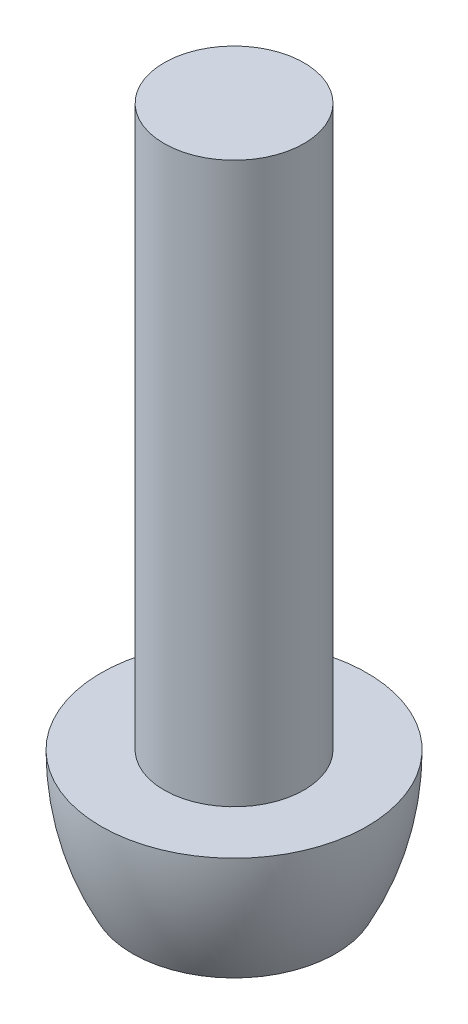
ISO-10303-21;
HEADER;
FILE_DESCRIPTION(('STEP AP214'),'2;1');
FILE_NAME('part.step','',(''),(''),'','','');
FILE_SCHEMA(('AUTOMOTIVE_DESIGN { 1 0 10303 214 1 1 1 1 }'));
ENDSEC;
DATA;
#1=APPLICATION_CONTEXT('core data for automotive mechanical design processes');
#2=APPLICATION_PROTOCOL_DEFINITION('international standard','automotive_design',2000,#1);
#3=PRODUCT_CONTEXT('',#1,'mechanical');
#4=PRODUCT('Part','Part','',(#3));
#5=PRODUCT_RELATED_PRODUCT_CATEGORY('part','',(#4));
#6=PRODUCT_DEFINITION_FORMATION('','',#4);
#7=PRODUCT_DEFINITION_CONTEXT('part definition',#1,'design');
#8=PRODUCT_DEFINITION('design','',#6,#7);
#9=PRODUCT_DEFINITION_SHAPE('','',#8);
#10=(LENGTH_UNIT() NAMED_UNIT(*) SI_UNIT(.MILLI.,.METRE.));
#11=(NAMED_UNIT(*) PLANE_ANGLE_UNIT() SI_UNIT($,.RADIAN.));
#12=(NAMED_UNIT(*) SI_UNIT($,.STERADIAN.) SOLID_ANGLE_UNIT());
#13=UNCERTAINTY_MEASURE_WITH_UNIT(LENGTH_MEASURE(1.E-05),#10,'distance_accuracy_value','');
#14=(GEOMETRIC_REPRESENTATION_CONTEXT(3) GLOBAL_UNCERTAINTY_ASSIGNED_CONTEXT((#13)) GLOBAL_UNIT_ASSIGNED_CONTEXT((#10,
#11,#12)) REPRESENTATION_CONTEXT('',''));
#15=CARTESIAN_POINT('',(0.,0.,0.));
#16=DIRECTION('',(0.,0.,1.));
#17=DIRECTION('',(1.,0.,0.));
#18=AXIS2_PLACEMENT_3D('',#15,#16,#17);
#19=CARTESIAN_POINT('',(0.,8.,0.));
#20=DIRECTION('',(0.,-1.,0.));
#21=DIRECTION('',(0.,0.,-1.));
#22=AXIS2_PLACEMENT_3D('',#19,#20,#21);
#23=CYLINDRICAL_SURFACE('',#22,1.);
#24=CARTESIAN_POINT('',(0.,8.,0.));
#25=DIRECTION('',(0.,1.,0.));
#26=DIRECTION('',(0.,0.,1.));
#27=AXIS2_PLACEMENT_3D('',#24,#25,#26);
#28=CIRCLE('',#27,1.);
#29=CARTESIAN_POINT('',(0.,8.,1.));
#30=VERTEX_POINT('',#29);
#31=EDGE_CURVE('E11',#30,#30,#28,.T.);
#32=ORIENTED_EDGE('',*,*,#31,.F.);
#33=EDGE_LOOP('',(#32));
#34=FACE_BOUND('',#33,.T.);
#35=CARTESIAN_POINT('',(0.,0.,0.));
#36=DIRECTION('',(0.,1.,0.));
#37=DIRECTION('',(0.,0.,1.));
#38=AXIS2_PLACEMENT_3D('',#35,#36,#37);
#39=CIRCLE('',#38,1.);
#40=CARTESIAN_POINT('',(0.,0.,1.));
#41=VERTEX_POINT('',#40);
#42=EDGE_CURVE('E40',#41,#41,#39,.T.);
#43=ORIENTED_EDGE('',*,*,#42,.T.);
#44=EDGE_LOOP('',(#43));
#45=FACE_BOUND('',#44,.T.);
#46=ADVANCED_FACE('F37',(#34,#45),#23,.T.);
#47=CARTESIAN_POINT('',(0.,8.,0.));
#48=DIRECTION('',(0.,1.,0.));
#49=DIRECTION('',(0.,0.,1.));
#50=AXIS2_PLACEMENT_3D('',#47,#48,#49);
#51=PLANE('',#50);
#52=ORIENTED_EDGE('',*,*,#31,.T.);
#53=EDGE_LOOP('',(#52));
#54=FACE_BOUND('',#53,.T.);
#55=ADVANCED_FACE('F158',(#54),#51,.T.);
#56=CARTESIAN_POINT('',(0.,0.,0.));
#57=DIRECTION('',(0.,1.,0.));
#58=DIRECTION('',(0.,0.,1.));
#59=AXIS2_PLACEMENT_3D('',#56,#57,#58);
#60=PLANE('',#59);
#61=ORIENTED_EDGE('',*,*,#42,.F.);
#62=EDGE_LOOP('',(#61));
#63=FACE_BOUND('',#62,.T.);
#64=CARTESIAN_POINT('',(0.,0.,0.));
#65=DIRECTION('',(0.,1.,0.));
#66=DIRECTION('',(0.,0.,1.));
#67=AXIS2_PLACEMENT_3D('',#64,#65,#66);
#68=CIRCLE('',#67,1.9);
#69=CARTESIAN_POINT('',(0.,0.,1.9));
#70=VERTEX_POINT('',#69);
#71=EDGE_CURVE('E138',#70,#70,#68,.T.);
#72=ORIENTED_EDGE('',*,*,#71,.T.);
#73=EDGE_LOOP('',(#72));
#74=FACE_BOUND('',#73,.T.);
#75=ADVANCED_FACE('F154',(#63,#74),#60,.T.);
#76=CARTESIAN_POINT('',(0.,0.,0.));
#77=DIRECTION('',(0.,1.,0.));
#78=DIRECTION('',(0.,0.,1.));
#79=AXIS2_PLACEMENT_3D('',#76,#77,#78);
#80=DEGENERATE_TOROIDAL_SURFACE('',#79,1.925,3.825,.F.);
#81=ORIENTED_EDGE('',*,*,#71,.F.);
#82=EDGE_LOOP('',(#81));
#83=FACE_BOUND('',#82,.T.);
#84=CARTESIAN_POINT('',(0.,-1.8,0.));
#85=DIRECTION('',(0.,1.,0.));
#86=DIRECTION('',(0.,0.,1.));
#87=AXIS2_PLACEMENT_3D('',#84,#85,#86);
#88=CIRCLE('',#87,1.45);
#89=CARTESIAN_POINT('',(0.,-1.8,1.45));
#90=VERTEX_POINT('',#89);
#91=EDGE_CURVE('E146',#90,#90,#88,.T.);
#92=ORIENTED_EDGE('',*,*,#91,.T.);
#93=EDGE_LOOP('',(#92));
#94=FACE_BOUND('',#93,.T.);
#95=ADVANCED_FACE('F157',(#83,#94),#80,.F.);
#96=CARTESIAN_POINT('',(0.,-1.8,0.));
#97=DIRECTION('',(0.,1.,0.));
#98=DIRECTION('',(0.,0.,1.));
#99=AXIS2_PLACEMENT_3D('',#96,#97,#98);
#100=PLANE('',#99);
#101=DIRECTION('',(1.,0.,0.));
#102=VECTOR('',#101,1.);
#103=CARTESIAN_POINT('',(-0.288675134594813,-1.8,-0.5));
#104=LINE('',#103,#102);
#105=CARTESIAN_POINT('',(-0.288675134594813,-1.8,-0.5));
#106=VERTEX_POINT('',#105);
#107=CARTESIAN_POINT('',(0.288675134594813,-1.8,-0.5));
#108=VERTEX_POINT('',#107);
#109=EDGE_CURVE('E125',#106,#108,#104,.T.);
#110=ORIENTED_EDGE('',*,*,#109,.F.);
#111=DIRECTION('',(0.5,0.,-0.866025403784439));
#112=VECTOR('',#111,1.);
#113=CARTESIAN_POINT('',(-0.577350269189626,-1.8,0.));
#114=LINE('',#113,#112);
#115=CARTESIAN_POINT('',(-0.577350269189626,-1.8,0.));
#116=VERTEX_POINT('',#115);
#117=EDGE_CURVE('E51',#116,#106,#114,.T.);
#118=ORIENTED_EDGE('',*,*,#117,.F.);
#119=DIRECTION('',(-0.5,0.,-0.866025403784438));
#120=VECTOR('',#119,1.);
#121=CARTESIAN_POINT('',(-0.288675134594813,-1.8,0.5));
#122=LINE('',#121,#120);
#123=CARTESIAN_POINT('',(-0.288675134594813,-1.8,0.5));
#124=VERTEX_POINT('',#123);
#125=EDGE_CURVE('E134',#124,#116,#122,.T.);
#126=ORIENTED_EDGE('',*,*,#125,.F.);
#127=DIRECTION('',(-1.,0.,0.));
#128=VECTOR('',#127,1.);
#129=CARTESIAN_POINT('',(0.288675134594812,-1.8,0.5));
#130=LINE('',#129,#128);
#131=CARTESIAN_POINT('',(0.288675134594812,-1.8,0.5));
#132=VERTEX_POINT('',#131);
#133=EDGE_CURVE('E132',#132,#124,#130,.T.);
#134=ORIENTED_EDGE('',*,*,#133,.F.);
#135=DIRECTION('',(-0.5,0.,0.866025403784438));
#136=VECTOR('',#135,1.);
#137=CARTESIAN_POINT('',(0.577350269189626,-1.8,0.));
#138=LINE('',#137,#136);
#139=CARTESIAN_POINT('',(0.577350269189626,-1.8,0.));
#140=VERTEX_POINT('',#139);
#141=EDGE_CURVE('E99',#140,#132,#138,.T.);
#142=ORIENTED_EDGE('',*,*,#141,.F.);
#143=DIRECTION('',(0.5,0.,0.866025403784439));
#144=VECTOR('',#143,1.);
#145=CARTESIAN_POINT('',(0.288675134594813,-1.8,-0.5));
#146=LINE('',#145,#144);
#147=EDGE_CURVE('E128',#108,#140,#146,.T.);
#148=ORIENTED_EDGE('',*,*,#147,.F.);
#149=EDGE_LOOP('',(#110,#118,#126,#134,#142,#148));
#150=FACE_BOUND('',#149,.T.);
#151=ORIENTED_EDGE('',*,*,#91,.F.);
#152=EDGE_LOOP('',(#151));
#153=FACE_BOUND('',#152,.T.);
#154=ADVANCED_FACE('F163',(#150,#153),#100,.F.);
#155=CARTESIAN_POINT('',(-0.577350269189626,-1.2,0.));
#156=DIRECTION('',(-0.866025403784439,0.,-0.5));
#157=DIRECTION('',(-0.5,0.,0.866025403784439));
#158=AXIS2_PLACEMENT_3D('',#155,#156,#157);
#159=PLANE('',#158);
#160=ORIENTED_EDGE('',*,*,#117,.T.);
#161=DIRECTION('',(0.,-1.,0.));
#162=VECTOR('',#161,1.);
#163=CARTESIAN_POINT('',(-0.288675134594813,-1.2,-0.5));
#164=LINE('',#163,#162);
#165=CARTESIAN_POINT('',(-0.288675134594813,-1.2,-0.5));
#166=VERTEX_POINT('',#165);
#167=EDGE_CURVE('E81',#166,#106,#164,.T.);
#168=ORIENTED_EDGE('',*,*,#167,.F.);
#169=DIRECTION('',(0.5,0.,-0.866025403784439));
#170=VECTOR('',#169,1.);
#171=CARTESIAN_POINT('',(-0.577350269189626,-1.2,0.));
#172=LINE('',#171,#170);
#173=CARTESIAN_POINT('',(-0.577350269189626,-1.2,0.));
#174=VERTEX_POINT('',#173);
#175=EDGE_CURVE('E136',#174,#166,#172,.T.);
#176=ORIENTED_EDGE('',*,*,#175,.F.);
#177=DIRECTION('',(0.,-1.,0.));
#178=VECTOR('',#177,1.);
#179=CARTESIAN_POINT('',(-0.577350269189626,-1.2,0.));
#180=LINE('',#179,#178);
#181=EDGE_CURVE('E59',#174,#116,#180,.T.);
#182=ORIENTED_EDGE('',*,*,#181,.T.);
#183=EDGE_LOOP('',(#160,#168,#176,#182));
#184=FACE_BOUND('',#183,.T.);
#185=ADVANCED_FACE('F168',(#184),#159,.F.);
#186=CARTESIAN_POINT('',(-0.288675134594813,-1.2,0.5));
#187=DIRECTION('',(-0.866025403784439,0.,0.5));
#188=DIRECTION('',(0.5,0.,0.866025403784439));
#189=AXIS2_PLACEMENT_3D('',#186,#187,#188);
#190=PLANE('',#189);
#191=ORIENTED_EDGE('',*,*,#125,.T.);
#192=ORIENTED_EDGE('',*,*,#181,.F.);
#193=DIRECTION('',(-0.5,0.,-0.866025403784438));
#194=VECTOR('',#193,1.);
#195=CARTESIAN_POINT('',(-0.288675134594813,-1.2,0.5));
#196=LINE('',#195,#194);
#197=CARTESIAN_POINT('',(-0.288675134594813,-1.2,0.5));
#198=VERTEX_POINT('',#197);
#199=EDGE_CURVE('E111',#198,#174,#196,.T.);
#200=ORIENTED_EDGE('',*,*,#199,.F.);
#201=DIRECTION('',(0.,-1.,0.));
#202=VECTOR('',#201,1.);
#203=CARTESIAN_POINT('',(-0.288675134594813,-1.2,0.5));
#204=LINE('',#203,#202);
#205=EDGE_CURVE('E103',#198,#124,#204,.T.);
#206=ORIENTED_EDGE('',*,*,#205,.T.);
#207=EDGE_LOOP('',(#191,#192,#200,#206));
#208=FACE_BOUND('',#207,.T.);
#209=ADVANCED_FACE('F205',(#208),#190,.F.);
#210=CARTESIAN_POINT('',(0.288675134594812,-1.2,0.5));
#211=DIRECTION('',(0.,0.,1.));
#212=DIRECTION('',(1.,0.,0.));
#213=AXIS2_PLACEMENT_3D('',#210,#211,#212);
#214=PLANE('',#213);
#215=ORIENTED_EDGE('',*,*,#133,.T.);
#216=ORIENTED_EDGE('',*,*,#205,.F.);
#217=DIRECTION('',(-1.,0.,0.));
#218=VECTOR('',#217,1.);
#219=CARTESIAN_POINT('',(0.288675134594812,-1.2,0.5));
#220=LINE('',#219,#218);
#221=CARTESIAN_POINT('',(0.288675134594812,-1.2,0.5));
#222=VERTEX_POINT('',#221);
#223=EDGE_CURVE('E107',#222,#198,#220,.T.);
#224=ORIENTED_EDGE('',*,*,#223,.F.);
#225=DIRECTION('',(0.,-1.,0.));
#226=VECTOR('',#225,1.);
#227=CARTESIAN_POINT('',(0.288675134594812,-1.2,0.5));
#228=LINE('',#227,#226);
#229=EDGE_CURVE('E92',#222,#132,#228,.T.);
#230=ORIENTED_EDGE('',*,*,#229,.T.);
#231=EDGE_LOOP('',(#215,#216,#224,#230));
#232=FACE_BOUND('',#231,.T.);
#233=ADVANCED_FACE('F108',(#232),#214,.F.);
#234=CARTESIAN_POINT('',(0.577350269189626,-1.2,0.));
#235=DIRECTION('',(0.866025403784438,0.,0.5));
#236=DIRECTION('',(0.5,0.,-0.866025403784439));
#237=AXIS2_PLACEMENT_3D('',#234,#235,#236);
#238=PLANE('',#237);
#239=ORIENTED_EDGE('',*,*,#141,.T.);
#240=ORIENTED_EDGE('',*,*,#229,.F.);
#241=DIRECTION('',(-0.5,0.,0.866025403784438));
#242=VECTOR('',#241,1.);
#243=CARTESIAN_POINT('',(0.577350269189626,-1.2,0.));
#244=LINE('',#243,#242);
#245=CARTESIAN_POINT('',(0.577350269189626,-1.2,0.));
#246=VERTEX_POINT('',#245);
#247=EDGE_CURVE('E96',#246,#222,#244,.T.);
#248=ORIENTED_EDGE('',*,*,#247,.F.);
#249=DIRECTION('',(0.,-1.,0.));
#250=VECTOR('',#249,1.);
#251=CARTESIAN_POINT('',(0.577350269189626,-1.2,0.));
#252=LINE('',#251,#250);
#253=EDGE_CURVE('E104',#246,#140,#252,.T.);
#254=ORIENTED_EDGE('',*,*,#253,.T.);
#255=EDGE_LOOP('',(#239,#240,#248,#254));
#256=FACE_BOUND('',#255,.T.);
#257=ADVANCED_FACE('F94',(#256),#238,.F.);
#258=CARTESIAN_POINT('',(0.288675134594813,-1.2,-0.5));
#259=DIRECTION('',(0.866025403784439,0.,-0.5));
#260=DIRECTION('',(-0.5,0.,-0.866025403784439));
#261=AXIS2_PLACEMENT_3D('',#258,#259,#260);
#262=PLANE('',#261);
#263=ORIENTED_EDGE('',*,*,#147,.T.);
#264=ORIENTED_EDGE('',*,*,#253,.F.);
#265=DIRECTION('',(0.5,0.,0.866025403784439));
#266=VECTOR('',#265,1.);
#267=CARTESIAN_POINT('',(0.288675134594813,-1.2,-0.5));
#268=LINE('',#267,#266);
#269=CARTESIAN_POINT('',(0.288675134594813,-1.2,-0.5));
#270=VERTEX_POINT('',#269);
#271=EDGE_CURVE('E117',#270,#246,#268,.T.);
#272=ORIENTED_EDGE('',*,*,#271,.F.);
#273=DIRECTION('',(0.,-1.,0.));
#274=VECTOR('',#273,1.);
#275=CARTESIAN_POINT('',(0.288675134594813,-1.2,-0.5));
#276=LINE('',#275,#274);
#277=EDGE_CURVE('E141',#270,#108,#276,.T.);
#278=ORIENTED_EDGE('',*,*,#277,.T.);
#279=EDGE_LOOP('',(#263,#264,#272,#278));
#280=FACE_BOUND('',#279,.T.);
#281=ADVANCED_FACE('F229',(#280),#262,.F.);
#282=CARTESIAN_POINT('',(-0.288675134594813,-1.2,-0.5));
#283=DIRECTION('',(0.,0.,-1.));
#284=DIRECTION('',(-1.,0.,0.));
#285=AXIS2_PLACEMENT_3D('',#282,#283,#284);
#286=PLANE('',#285);
#287=ORIENTED_EDGE('',*,*,#109,.T.);
#288=ORIENTED_EDGE('',*,*,#277,.F.);
#289=DIRECTION('',(1.,0.,0.));
#290=VECTOR('',#289,1.);
#291=CARTESIAN_POINT('',(-0.288675134594813,-1.2,-0.5));
#292=LINE('',#291,#290);
#293=EDGE_CURVE('E119',#166,#270,#292,.T.);
#294=ORIENTED_EDGE('',*,*,#293,.F.);
#295=ORIENTED_EDGE('',*,*,#167,.T.);
#296=EDGE_LOOP('',(#287,#288,#294,#295));
#297=FACE_BOUND('',#296,.T.);
#298=ADVANCED_FACE('F238',(#297),#286,.F.);
#299=CARTESIAN_POINT('',(0.,-1.2,0.));
#300=DIRECTION('',(0.,-1.,0.));
#301=DIRECTION('',(0.,0.,-1.));
#302=AXIS2_PLACEMENT_3D('',#299,#300,#301);
#303=PLANE('',#302);
#304=ORIENTED_EDGE('',*,*,#175,.T.);
#305=ORIENTED_EDGE('',*,*,#293,.T.);
#306=ORIENTED_EDGE('',*,*,#271,.T.);
#307=ORIENTED_EDGE('',*,*,#247,.T.);
#308=ORIENTED_EDGE('',*,*,#223,.T.);
#309=ORIENTED_EDGE('',*,*,#199,.T.);
#310=EDGE_LOOP('',(#304,#305,#306,#307,#308,#309));
#311=FACE_BOUND('',#310,.T.);
#312=ADVANCED_FACE('F114',(#311),#303,.T.);
#313=CLOSED_SHELL('',(#46,#55,#75,#95,#154,#185,#209,#233,#257,#281,#298,#312));
#314=MANIFOLD_SOLID_BREP('B2',#313);
#315=ADVANCED_BREP_SHAPE_REPRESENTATION('',(#18,#314),#14);
#316=SHAPE_DEFINITION_REPRESENTATION(#9,#315);
ENDSEC;
END-ISO-10303-21;
